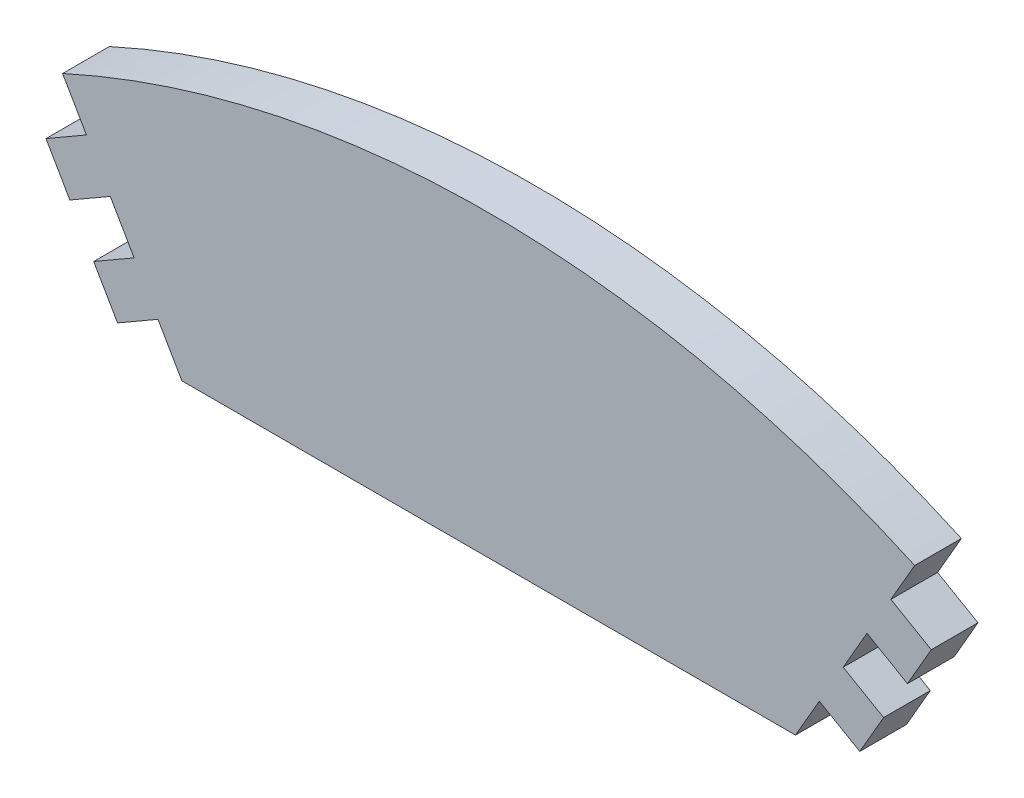
ISO-10303-21;
HEADER;
FILE_DESCRIPTION(('STEP AP214'),'2;1');
FILE_NAME('part.step','',(''),(''),'','','');
FILE_SCHEMA(('AUTOMOTIVE_DESIGN { 1 0 10303 214 1 1 1 1 }'));
ENDSEC;
DATA;
#1=APPLICATION_CONTEXT('core data for automotive mechanical design processes');
#2=APPLICATION_PROTOCOL_DEFINITION('international standard','automotive_design',2000,#1);
#3=PRODUCT_CONTEXT('',#1,'mechanical');
#4=PRODUCT('Part','Part','',(#3));
#5=PRODUCT_RELATED_PRODUCT_CATEGORY('part','',(#4));
#6=PRODUCT_DEFINITION_FORMATION('','',#4);
#7=PRODUCT_DEFINITION_CONTEXT('part definition',#1,'design');
#8=PRODUCT_DEFINITION('design','',#6,#7);
#9=PRODUCT_DEFINITION_SHAPE('','',#8);
#10=(LENGTH_UNIT() NAMED_UNIT(*) SI_UNIT(.MILLI.,.METRE.));
#11=(NAMED_UNIT(*) PLANE_ANGLE_UNIT() SI_UNIT($,.RADIAN.));
#12=(NAMED_UNIT(*) SI_UNIT($,.STERADIAN.) SOLID_ANGLE_UNIT());
#13=UNCERTAINTY_MEASURE_WITH_UNIT(LENGTH_MEASURE(1.E-05),#10,'distance_accuracy_value','');
#14=(GEOMETRIC_REPRESENTATION_CONTEXT(3) GLOBAL_UNCERTAINTY_ASSIGNED_CONTEXT((#13)) GLOBAL_UNIT_ASSIGNED_CONTEXT((#10,
#11,#12)) REPRESENTATION_CONTEXT('',''));
#15=CARTESIAN_POINT('',(0.,0.,0.));
#16=DIRECTION('',(0.,0.,1.));
#17=DIRECTION('',(1.,0.,0.));
#18=AXIS2_PLACEMENT_3D('',#15,#16,#17);
#19=CARTESIAN_POINT('',(-35.403,82.4086096476236,5.));
#20=DIRECTION('',(-0.499999999999997,0.86602540378444,0.));
#21=DIRECTION('',(-0.866025403784441,-0.499999999999997,0.));
#22=AXIS2_PLACEMENT_3D('',#19,#20,#21);
#23=PLANE('',#22);
#24=DIRECTION('',(0.86602540378444,0.499999999999997,0.));
#25=VECTOR('',#24,1.);
#26=CARTESIAN_POINT('',(-35.403,82.4086096476236,0.));
#27=LINE('',#26,#25);
#28=CARTESIAN_POINT('',(-39.733127018922,79.9086096476237,0.));
#29=VERTEX_POINT('',#28);
#30=CARTESIAN_POINT('',(-35.403,82.4086096476236,0.));
#31=VERTEX_POINT('',#30);
#32=EDGE_CURVE('E201',#29,#31,#27,.T.);
#33=ORIENTED_EDGE('',*,*,#32,.T.);
#34=DIRECTION('',(0.,0.,-1.));
#35=VECTOR('',#34,1.);
#36=CARTESIAN_POINT('',(-35.403,82.4086096476236,5.));
#37=LINE('',#36,#35);
#38=CARTESIAN_POINT('',(-35.403,82.4086096476236,5.));
#39=VERTEX_POINT('',#38);
#40=EDGE_CURVE('E11',#39,#31,#37,.T.);
#41=ORIENTED_EDGE('',*,*,#40,.F.);
#42=DIRECTION('',(0.86602540378444,0.499999999999997,0.));
#43=VECTOR('',#42,1.);
#44=CARTESIAN_POINT('',(-35.403,82.4086096476236,5.));
#45=LINE('',#44,#43);
#46=CARTESIAN_POINT('',(-39.733127018922,79.9086096476237,5.));
#47=VERTEX_POINT('',#46);
#48=EDGE_CURVE('E239',#47,#39,#45,.T.);
#49=ORIENTED_EDGE('',*,*,#48,.F.);
#50=DIRECTION('',(0.,0.,-1.));
#51=VECTOR('',#50,1.);
#52=CARTESIAN_POINT('',(-39.733127018922,79.9086096476237,5.));
#53=LINE('',#52,#51);
#54=EDGE_CURVE('E197',#47,#29,#53,.T.);
#55=ORIENTED_EDGE('',*,*,#54,.T.);
#56=EDGE_LOOP('',(#33,#41,#49,#55));
#57=FACE_BOUND('',#56,.T.);
#58=ADVANCED_FACE('F33',(#57),#23,.F.);
#59=CARTESIAN_POINT('',(-32.85,77.9866839359003,5.));
#60=DIRECTION('',(0.866025403784441,0.499999999999996,0.));
#61=DIRECTION('',(-0.499999999999996,0.866025403784441,0.));
#62=AXIS2_PLACEMENT_3D('',#59,#60,#61);
#63=PLANE('',#62);
#64=DIRECTION('',(0.499999999999996,-0.866025403784441,0.));
#65=VECTOR('',#64,1.);
#66=CARTESIAN_POINT('',(-32.85,77.9866839359003,0.));
#67=LINE('',#66,#65);
#68=CARTESIAN_POINT('',(-32.85,77.9866839359003,0.));
#69=VERTEX_POINT('',#68);
#70=EDGE_CURVE('E204',#31,#69,#67,.T.);
#71=ORIENTED_EDGE('',*,*,#70,.T.);
#72=DIRECTION('',(0.,0.,-1.));
#73=VECTOR('',#72,1.);
#74=CARTESIAN_POINT('',(-32.85,77.9866839359003,5.));
#75=LINE('',#74,#73);
#76=CARTESIAN_POINT('',(-32.85,77.9866839359003,5.));
#77=VERTEX_POINT('',#76);
#78=EDGE_CURVE('E41',#77,#69,#75,.T.);
#79=ORIENTED_EDGE('',*,*,#78,.F.);
#80=DIRECTION('',(0.499999999999996,-0.866025403784441,0.));
#81=VECTOR('',#80,1.);
#82=CARTESIAN_POINT('',(-32.85,77.9866839359003,5.));
#83=LINE('',#82,#81);
#84=EDGE_CURVE('E128',#39,#77,#83,.T.);
#85=ORIENTED_EDGE('',*,*,#84,.F.);
#86=ORIENTED_EDGE('',*,*,#40,.T.);
#87=EDGE_LOOP('',(#71,#79,#85,#86));
#88=FACE_BOUND('',#87,.T.);
#89=ADVANCED_FACE('F357',(#88),#63,.F.);
#90=CARTESIAN_POINT('',(-32.85,77.9866839359003,5.));
#91=DIRECTION('',(0.,1.,0.));
#92=DIRECTION('',(0.,0.,1.));
#93=AXIS2_PLACEMENT_3D('',#90,#91,#92);
#94=PLANE('',#93);
#95=DIRECTION('',(1.,0.,0.));
#96=VECTOR('',#95,1.);
#97=CARTESIAN_POINT('',(-32.85,77.9866839359003,0.));
#98=LINE('',#97,#96);
#99=CARTESIAN_POINT('',(32.85,77.9866839359003,0.));
#100=VERTEX_POINT('',#99);
#101=EDGE_CURVE('E206',#69,#100,#98,.T.);
#102=ORIENTED_EDGE('',*,*,#101,.T.);
#103=DIRECTION('',(0.,0.,-1.));
#104=VECTOR('',#103,1.);
#105=CARTESIAN_POINT('',(32.85,77.9866839359003,5.));
#106=LINE('',#105,#104);
#107=CARTESIAN_POINT('',(32.85,77.9866839359003,5.));
#108=VERTEX_POINT('',#107);
#109=EDGE_CURVE('E282',#108,#100,#106,.T.);
#110=ORIENTED_EDGE('',*,*,#109,.F.);
#111=DIRECTION('',(1.,0.,0.));
#112=VECTOR('',#111,1.);
#113=CARTESIAN_POINT('',(-32.85,77.9866839359003,5.));
#114=LINE('',#113,#112);
#115=EDGE_CURVE('E290',#77,#108,#114,.T.);
#116=ORIENTED_EDGE('',*,*,#115,.F.);
#117=ORIENTED_EDGE('',*,*,#78,.T.);
#118=EDGE_LOOP('',(#102,#110,#116,#117));
#119=FACE_BOUND('',#118,.T.);
#120=ADVANCED_FACE('F288',(#119),#94,.F.);
#121=CARTESIAN_POINT('',(32.85,77.9866839359003,5.));
#122=DIRECTION('',(-0.86602540378444,0.499999999999997,0.));
#123=DIRECTION('',(-0.499999999999997,-0.86602540378444,0.));
#124=AXIS2_PLACEMENT_3D('',#121,#122,#123);
#125=PLANE('',#124);
#126=DIRECTION('',(0.499999999999997,0.86602540378444,0.));
#127=VECTOR('',#126,1.);
#128=CARTESIAN_POINT('',(32.85,77.9866839359003,0.));
#129=LINE('',#128,#127);
#130=CARTESIAN_POINT('',(35.403,82.4086096476236,0.));
#131=VERTEX_POINT('',#130);
#132=EDGE_CURVE('E208',#100,#131,#129,.T.);
#133=ORIENTED_EDGE('',*,*,#132,.T.);
#134=DIRECTION('',(0.,0.,-1.));
#135=VECTOR('',#134,1.);
#136=CARTESIAN_POINT('',(35.403,82.4086096476236,5.));
#137=LINE('',#136,#135);
#138=CARTESIAN_POINT('',(35.403,82.4086096476236,5.));
#139=VERTEX_POINT('',#138);
#140=EDGE_CURVE('E279',#139,#131,#137,.T.);
#141=ORIENTED_EDGE('',*,*,#140,.F.);
#142=DIRECTION('',(0.499999999999997,0.86602540378444,0.));
#143=VECTOR('',#142,1.);
#144=CARTESIAN_POINT('',(32.85,77.9866839359003,5.));
#145=LINE('',#144,#143);
#146=EDGE_CURVE('E308',#108,#139,#145,.T.);
#147=ORIENTED_EDGE('',*,*,#146,.F.);
#148=ORIENTED_EDGE('',*,*,#109,.T.);
#149=EDGE_LOOP('',(#133,#141,#147,#148));
#150=FACE_BOUND('',#149,.T.);
#151=ADVANCED_FACE('F299',(#150),#125,.F.);
#152=CARTESIAN_POINT('',(35.403,82.4086096476236,5.));
#153=DIRECTION('',(0.499999999999997,0.86602540378444,0.));
#154=DIRECTION('',(-0.866025403784441,0.499999999999997,0.));
#155=AXIS2_PLACEMENT_3D('',#152,#153,#154);
#156=PLANE('',#155);
#157=DIRECTION('',(0.86602540378444,-0.499999999999997,0.));
#158=VECTOR('',#157,1.);
#159=CARTESIAN_POINT('',(35.403,82.4086096476236,0.));
#160=LINE('',#159,#158);
#161=CARTESIAN_POINT('',(39.733127018922,79.9086096476237,0.));
#162=VERTEX_POINT('',#161);
#163=EDGE_CURVE('E210',#131,#162,#160,.T.);
#164=ORIENTED_EDGE('',*,*,#163,.T.);
#165=DIRECTION('',(0.,0.,-1.));
#166=VECTOR('',#165,1.);
#167=CARTESIAN_POINT('',(39.733127018922,79.9086096476237,5.));
#168=LINE('',#167,#166);
#169=CARTESIAN_POINT('',(39.733127018922,79.9086096476237,5.));
#170=VERTEX_POINT('',#169);
#171=EDGE_CURVE('E276',#170,#162,#168,.T.);
#172=ORIENTED_EDGE('',*,*,#171,.F.);
#173=DIRECTION('',(0.86602540378444,-0.499999999999997,0.));
#174=VECTOR('',#173,1.);
#175=CARTESIAN_POINT('',(35.403,82.4086096476236,5.));
#176=LINE('',#175,#174);
#177=EDGE_CURVE('E305',#139,#170,#176,.T.);
#178=ORIENTED_EDGE('',*,*,#177,.F.);
#179=ORIENTED_EDGE('',*,*,#140,.T.);
#180=EDGE_LOOP('',(#164,#172,#178,#179));
#181=FACE_BOUND('',#180,.T.);
#182=ADVANCED_FACE('F303',(#181),#156,.F.);
#183=CARTESIAN_POINT('',(39.733127018922,79.9086096476237,5.));
#184=DIRECTION('',(-0.86602540378444,0.499999999999997,0.));
#185=DIRECTION('',(-0.499999999999997,-0.86602540378444,0.));
#186=AXIS2_PLACEMENT_3D('',#183,#184,#185);
#187=PLANE('',#186);
#188=DIRECTION('',(0.499999999999997,0.86602540378444,0.));
#189=VECTOR('',#188,1.);
#190=CARTESIAN_POINT('',(39.733127018922,79.9086096476237,0.));
#191=LINE('',#190,#189);
#192=CARTESIAN_POINT('',(42.286127018922,84.3305353593471,0.));
#193=VERTEX_POINT('',#192);
#194=EDGE_CURVE('E212',#162,#193,#191,.T.);
#195=ORIENTED_EDGE('',*,*,#194,.T.);
#196=DIRECTION('',(0.,0.,-1.));
#197=VECTOR('',#196,1.);
#198=CARTESIAN_POINT('',(42.286127018922,84.3305353593471,5.));
#199=LINE('',#198,#197);
#200=CARTESIAN_POINT('',(42.286127018922,84.3305353593471,5.));
#201=VERTEX_POINT('',#200);
#202=EDGE_CURVE('E273',#201,#193,#199,.T.);
#203=ORIENTED_EDGE('',*,*,#202,.F.);
#204=DIRECTION('',(0.499999999999997,0.86602540378444,0.));
#205=VECTOR('',#204,1.);
#206=CARTESIAN_POINT('',(39.733127018922,79.9086096476237,5.));
#207=LINE('',#206,#205);
#208=EDGE_CURVE('E307',#170,#201,#207,.T.);
#209=ORIENTED_EDGE('',*,*,#208,.F.);
#210=ORIENTED_EDGE('',*,*,#171,.T.);
#211=EDGE_LOOP('',(#195,#203,#209,#210));
#212=FACE_BOUND('',#211,.T.);
#213=ADVANCED_FACE('F370',(#212),#187,.F.);
#214=CARTESIAN_POINT('',(42.286127018922,84.3305353593471,5.));
#215=DIRECTION('',(-0.499999999999999,-0.866025403784439,0.));
#216=DIRECTION('',(0.866025403784439,-0.499999999999999,0.));
#217=AXIS2_PLACEMENT_3D('',#214,#215,#216);
#218=PLANE('',#217);
#219=DIRECTION('',(-0.866025403784439,0.499999999999999,0.));
#220=VECTOR('',#219,1.);
#221=CARTESIAN_POINT('',(42.286127018922,84.3305353593471,0.));
#222=LINE('',#221,#220);
#223=CARTESIAN_POINT('',(37.956,86.830535359347,0.));
#224=VERTEX_POINT('',#223);
#225=EDGE_CURVE('E214',#193,#224,#222,.T.);
#226=ORIENTED_EDGE('',*,*,#225,.T.);
#227=DIRECTION('',(0.,0.,-1.));
#228=VECTOR('',#227,1.);
#229=CARTESIAN_POINT('',(37.956,86.830535359347,5.));
#230=LINE('',#229,#228);
#231=CARTESIAN_POINT('',(37.956,86.830535359347,5.));
#232=VERTEX_POINT('',#231);
#233=EDGE_CURVE('E270',#232,#224,#230,.T.);
#234=ORIENTED_EDGE('',*,*,#233,.F.);
#235=DIRECTION('',(-0.866025403784439,0.499999999999999,0.));
#236=VECTOR('',#235,1.);
#237=CARTESIAN_POINT('',(42.286127018922,84.3305353593471,5.));
#238=LINE('',#237,#236);
#239=EDGE_CURVE('E310',#201,#232,#238,.T.);
#240=ORIENTED_EDGE('',*,*,#239,.F.);
#241=ORIENTED_EDGE('',*,*,#202,.T.);
#242=EDGE_LOOP('',(#226,#234,#240,#241));
#243=FACE_BOUND('',#242,.T.);
#244=ADVANCED_FACE('F373',(#243),#218,.F.);
#245=CARTESIAN_POINT('',(37.956,86.830535359347,5.));
#246=DIRECTION('',(-0.866025403784441,0.499999999999996,0.));
#247=DIRECTION('',(-0.499999999999996,-0.866025403784441,0.));
#248=AXIS2_PLACEMENT_3D('',#245,#246,#247);
#249=PLANE('',#248);
#250=DIRECTION('',(0.499999999999996,0.866025403784441,0.));
#251=VECTOR('',#250,1.);
#252=CARTESIAN_POINT('',(37.956,86.830535359347,0.));
#253=LINE('',#252,#251);
#254=CARTESIAN_POINT('',(40.5089999999999,91.2524610710703,0.));
#255=VERTEX_POINT('',#254);
#256=EDGE_CURVE('E216',#224,#255,#253,.T.);
#257=ORIENTED_EDGE('',*,*,#256,.T.);
#258=DIRECTION('',(0.,0.,-1.));
#259=VECTOR('',#258,1.);
#260=CARTESIAN_POINT('',(40.5089999999999,91.2524610710703,5.));
#261=LINE('',#260,#259);
#262=CARTESIAN_POINT('',(40.5089999999999,91.2524610710703,5.));
#263=VERTEX_POINT('',#262);
#264=EDGE_CURVE('E267',#263,#255,#261,.T.);
#265=ORIENTED_EDGE('',*,*,#264,.F.);
#266=DIRECTION('',(0.499999999999996,0.866025403784441,0.));
#267=VECTOR('',#266,1.);
#268=CARTESIAN_POINT('',(37.956,86.830535359347,5.));
#269=LINE('',#268,#267);
#270=EDGE_CURVE('E316',#232,#263,#269,.T.);
#271=ORIENTED_EDGE('',*,*,#270,.F.);
#272=ORIENTED_EDGE('',*,*,#233,.T.);
#273=EDGE_LOOP('',(#257,#265,#271,#272));
#274=FACE_BOUND('',#273,.T.);
#275=ADVANCED_FACE('F377',(#274),#249,.F.);
#276=CARTESIAN_POINT('',(40.5089999999999,91.2524610710703,5.));
#277=DIRECTION('',(0.499999999999997,0.86602540378444,0.));
#278=DIRECTION('',(-0.866025403784441,0.499999999999997,0.));
#279=AXIS2_PLACEMENT_3D('',#276,#277,#278);
#280=PLANE('',#279);
#281=DIRECTION('',(0.86602540378444,-0.499999999999997,0.));
#282=VECTOR('',#281,1.);
#283=CARTESIAN_POINT('',(40.5089999999999,91.2524610710703,0.));
#284=LINE('',#283,#282);
#285=CARTESIAN_POINT('',(44.839127018922,88.7524610710704,0.));
#286=VERTEX_POINT('',#285);
#287=EDGE_CURVE('E218',#255,#286,#284,.T.);
#288=ORIENTED_EDGE('',*,*,#287,.T.);
#289=DIRECTION('',(0.,0.,-1.));
#290=VECTOR('',#289,1.);
#291=CARTESIAN_POINT('',(44.839127018922,88.7524610710704,5.));
#292=LINE('',#291,#290);
#293=CARTESIAN_POINT('',(44.839127018922,88.7524610710704,5.));
#294=VERTEX_POINT('',#293);
#295=EDGE_CURVE('E264',#294,#286,#292,.T.);
#296=ORIENTED_EDGE('',*,*,#295,.F.);
#297=DIRECTION('',(0.86602540378444,-0.499999999999997,0.));
#298=VECTOR('',#297,1.);
#299=CARTESIAN_POINT('',(40.5089999999999,91.2524610710703,5.));
#300=LINE('',#299,#298);
#301=EDGE_CURVE('E318',#263,#294,#300,.T.);
#302=ORIENTED_EDGE('',*,*,#301,.F.);
#303=ORIENTED_EDGE('',*,*,#264,.T.);
#304=EDGE_LOOP('',(#288,#296,#302,#303));
#305=FACE_BOUND('',#304,.T.);
#306=ADVANCED_FACE('F381',(#305),#280,.F.);
#307=CARTESIAN_POINT('',(44.839127018922,88.7524610710704,5.));
#308=DIRECTION('',(-0.866025403784423,0.500000000000028,0.));
#309=DIRECTION('',(-0.500000000000028,-0.866025403784423,0.));
#310=AXIS2_PLACEMENT_3D('',#307,#308,#309);
#311=PLANE('',#310);
#312=DIRECTION('',(0.500000000000028,0.866025403784423,0.));
#313=VECTOR('',#312,1.);
#314=CARTESIAN_POINT('',(44.839127018922,88.7524610710704,0.));
#315=LINE('',#314,#313);
#316=CARTESIAN_POINT('',(47.3921270189221,93.1743867827937,0.));
#317=VERTEX_POINT('',#316);
#318=EDGE_CURVE('E220',#286,#317,#315,.T.);
#319=ORIENTED_EDGE('',*,*,#318,.T.);
#320=DIRECTION('',(0.,0.,-1.));
#321=VECTOR('',#320,1.);
#322=CARTESIAN_POINT('',(47.3921270189221,93.1743867827937,5.));
#323=LINE('',#322,#321);
#324=CARTESIAN_POINT('',(47.3921270189221,93.1743867827937,5.));
#325=VERTEX_POINT('',#324);
#326=EDGE_CURVE('E261',#325,#317,#323,.T.);
#327=ORIENTED_EDGE('',*,*,#326,.F.);
#328=DIRECTION('',(0.500000000000028,0.866025403784423,0.));
#329=VECTOR('',#328,1.);
#330=CARTESIAN_POINT('',(44.839127018922,88.7524610710704,5.));
#331=LINE('',#330,#329);
#332=EDGE_CURVE('E320',#294,#325,#331,.T.);
#333=ORIENTED_EDGE('',*,*,#332,.F.);
#334=ORIENTED_EDGE('',*,*,#295,.T.);
#335=EDGE_LOOP('',(#319,#327,#333,#334));
#336=FACE_BOUND('',#335,.T.);
#337=ADVANCED_FACE('F385',(#336),#311,.F.);
#338=CARTESIAN_POINT('',(47.3921270189221,93.1743867827937,5.));
#339=DIRECTION('',(-0.499999999999998,-0.86602540378444,0.));
#340=DIRECTION('',(0.86602540378444,-0.499999999999998,0.));
#341=AXIS2_PLACEMENT_3D('',#338,#339,#340);
#342=PLANE('',#341);
#343=DIRECTION('',(-0.86602540378444,0.499999999999998,0.));
#344=VECTOR('',#343,1.);
#345=CARTESIAN_POINT('',(47.3921270189221,93.1743867827937,0.));
#346=LINE('',#345,#344);
#347=CARTESIAN_POINT('',(43.0619999999999,95.6743867827937,0.));
#348=VERTEX_POINT('',#347);
#349=EDGE_CURVE('E222',#317,#348,#346,.T.);
#350=ORIENTED_EDGE('',*,*,#349,.T.);
#351=DIRECTION('',(0.,0.,-1.));
#352=VECTOR('',#351,1.);
#353=CARTESIAN_POINT('',(43.0619999999999,95.6743867827937,5.));
#354=LINE('',#353,#352);
#355=CARTESIAN_POINT('',(43.0619999999999,95.6743867827937,5.));
#356=VERTEX_POINT('',#355);
#357=EDGE_CURVE('E258',#356,#348,#354,.T.);
#358=ORIENTED_EDGE('',*,*,#357,.F.);
#359=DIRECTION('',(-0.86602540378444,0.499999999999998,0.));
#360=VECTOR('',#359,1.);
#361=CARTESIAN_POINT('',(47.3921270189221,93.1743867827937,5.));
#362=LINE('',#361,#360);
#363=EDGE_CURVE('E322',#325,#356,#362,.T.);
#364=ORIENTED_EDGE('',*,*,#363,.F.);
#365=ORIENTED_EDGE('',*,*,#326,.T.);
#366=EDGE_LOOP('',(#350,#358,#364,#365));
#367=FACE_BOUND('',#366,.T.);
#368=ADVANCED_FACE('F389',(#367),#342,.F.);
#369=CARTESIAN_POINT('',(43.0619999999999,95.6743867827937,5.));
#370=DIRECTION('',(-0.86602540378444,0.499999999999997,0.));
#371=DIRECTION('',(-0.499999999999997,-0.86602540378444,0.));
#372=AXIS2_PLACEMENT_3D('',#369,#370,#371);
#373=PLANE('',#372);
#374=DIRECTION('',(0.499999999999997,0.86602540378444,0.));
#375=VECTOR('',#374,1.);
#376=CARTESIAN_POINT('',(43.0619999999999,95.6743867827937,0.));
#377=LINE('',#376,#375);
#378=CARTESIAN_POINT('',(45.6149999999999,100.096312494517,0.));
#379=VERTEX_POINT('',#378);
#380=EDGE_CURVE('E224',#348,#379,#377,.T.);
#381=ORIENTED_EDGE('',*,*,#380,.T.);
#382=DIRECTION('',(0.,0.,-1.));
#383=VECTOR('',#382,1.);
#384=CARTESIAN_POINT('',(45.6149999999999,100.096312494517,5.));
#385=LINE('',#384,#383);
#386=CARTESIAN_POINT('',(45.6149999999999,100.096312494517,5.));
#387=VERTEX_POINT('',#386);
#388=EDGE_CURVE('E255',#387,#379,#385,.T.);
#389=ORIENTED_EDGE('',*,*,#388,.F.);
#390=DIRECTION('',(0.499999999999997,0.86602540378444,0.));
#391=VECTOR('',#390,1.);
#392=CARTESIAN_POINT('',(43.0619999999999,95.6743867827937,5.));
#393=LINE('',#392,#391);
#394=EDGE_CURVE('E324',#356,#387,#393,.T.);
#395=ORIENTED_EDGE('',*,*,#394,.F.);
#396=ORIENTED_EDGE('',*,*,#357,.T.);
#397=EDGE_LOOP('',(#381,#389,#395,#396));
#398=FACE_BOUND('',#397,.T.);
#399=ADVANCED_FACE('F393',(#398),#373,.F.);
#400=CARTESIAN_POINT('',(0.,0.,5.));
#401=DIRECTION('',(0.,0.,-1.));
#402=DIRECTION('',(-1.,0.,0.));
#403=AXIS2_PLACEMENT_3D('',#400,#401,#402);
#404=CYLINDRICAL_SURFACE('',#403,110.);
#405=CARTESIAN_POINT('',(0.,0.,0.));
#406=DIRECTION('',(0.,0.,1.));
#407=DIRECTION('',(-1.,0.,0.));
#408=AXIS2_PLACEMENT_3D('',#405,#406,#407);
#409=CIRCLE('',#408,110.);
#410=CARTESIAN_POINT('',(-45.6149999999999,100.096312494517,0.));
#411=VERTEX_POINT('',#410);
#412=EDGE_CURVE('E226',#379,#411,#409,.T.);
#413=ORIENTED_EDGE('',*,*,#412,.T.);
#414=DIRECTION('',(0.,0.,-1.));
#415=VECTOR('',#414,1.);
#416=CARTESIAN_POINT('',(-45.6149999999999,100.096312494517,5.));
#417=LINE('',#416,#415);
#418=CARTESIAN_POINT('',(-45.6149999999999,100.096312494517,5.));
#419=VERTEX_POINT('',#418);
#420=EDGE_CURVE('E252',#419,#411,#417,.T.);
#421=ORIENTED_EDGE('',*,*,#420,.F.);
#422=CARTESIAN_POINT('',(0.,0.,5.));
#423=DIRECTION('',(0.,0.,1.));
#424=DIRECTION('',(-1.,0.,0.));
#425=AXIS2_PLACEMENT_3D('',#422,#423,#424);
#426=CIRCLE('',#425,110.);
#427=EDGE_CURVE('E326',#387,#419,#426,.T.);
#428=ORIENTED_EDGE('',*,*,#427,.F.);
#429=ORIENTED_EDGE('',*,*,#388,.T.);
#430=EDGE_LOOP('',(#413,#421,#428,#429));
#431=FACE_BOUND('',#430,.T.);
#432=ADVANCED_FACE('F397',(#431),#404,.T.);
#433=CARTESIAN_POINT('',(-43.0619999999999,95.6743867827937,5.));
#434=DIRECTION('',(0.86602540378444,0.499999999999997,0.));
#435=DIRECTION('',(-0.499999999999997,0.86602540378444,0.));
#436=AXIS2_PLACEMENT_3D('',#433,#434,#435);
#437=PLANE('',#436);
#438=DIRECTION('',(0.499999999999997,-0.86602540378444,0.));
#439=VECTOR('',#438,1.);
#440=CARTESIAN_POINT('',(-43.0619999999999,95.6743867827937,0.));
#441=LINE('',#440,#439);
#442=CARTESIAN_POINT('',(-43.0619999999999,95.6743867827937,0.));
#443=VERTEX_POINT('',#442);
#444=EDGE_CURVE('E228',#411,#443,#441,.T.);
#445=ORIENTED_EDGE('',*,*,#444,.T.);
#446=DIRECTION('',(0.,0.,-1.));
#447=VECTOR('',#446,1.);
#448=CARTESIAN_POINT('',(-43.0619999999999,95.6743867827937,5.));
#449=LINE('',#448,#447);
#450=CARTESIAN_POINT('',(-43.0619999999999,95.6743867827937,5.));
#451=VERTEX_POINT('',#450);
#452=EDGE_CURVE('E249',#451,#443,#449,.T.);
#453=ORIENTED_EDGE('',*,*,#452,.F.);
#454=DIRECTION('',(0.499999999999997,-0.86602540378444,0.));
#455=VECTOR('',#454,1.);
#456=CARTESIAN_POINT('',(-43.0619999999999,95.6743867827937,5.));
#457=LINE('',#456,#455);
#458=EDGE_CURVE('E328',#419,#451,#457,.T.);
#459=ORIENTED_EDGE('',*,*,#458,.F.);
#460=ORIENTED_EDGE('',*,*,#420,.T.);
#461=EDGE_LOOP('',(#445,#453,#459,#460));
#462=FACE_BOUND('',#461,.T.);
#463=ADVANCED_FACE('F401',(#462),#437,.F.);
#464=CARTESIAN_POINT('',(-47.3921270189221,93.1743867827937,5.));
#465=DIRECTION('',(0.499999999999998,-0.86602540378444,0.));
#466=DIRECTION('',(0.86602540378444,0.499999999999998,0.));
#467=AXIS2_PLACEMENT_3D('',#464,#465,#466);
#468=PLANE('',#467);
#469=DIRECTION('',(-0.86602540378444,-0.499999999999998,0.));
#470=VECTOR('',#469,1.);
#471=CARTESIAN_POINT('',(-47.3921270189221,93.1743867827937,0.));
#472=LINE('',#471,#470);
#473=CARTESIAN_POINT('',(-47.3921270189221,93.1743867827937,0.));
#474=VERTEX_POINT('',#473);
#475=EDGE_CURVE('E230',#443,#474,#472,.T.);
#476=ORIENTED_EDGE('',*,*,#475,.T.);
#477=DIRECTION('',(0.,0.,-1.));
#478=VECTOR('',#477,1.);
#479=CARTESIAN_POINT('',(-47.3921270189221,93.1743867827937,5.));
#480=LINE('',#479,#478);
#481=CARTESIAN_POINT('',(-47.3921270189221,93.1743867827937,5.));
#482=VERTEX_POINT('',#481);
#483=EDGE_CURVE('E246',#482,#474,#480,.T.);
#484=ORIENTED_EDGE('',*,*,#483,.F.);
#485=DIRECTION('',(-0.86602540378444,-0.499999999999998,0.));
#486=VECTOR('',#485,1.);
#487=CARTESIAN_POINT('',(-47.3921270189221,93.1743867827937,5.));
#488=LINE('',#487,#486);
#489=EDGE_CURVE('E330',#451,#482,#488,.T.);
#490=ORIENTED_EDGE('',*,*,#489,.F.);
#491=ORIENTED_EDGE('',*,*,#452,.T.);
#492=EDGE_LOOP('',(#476,#484,#490,#491));
#493=FACE_BOUND('',#492,.T.);
#494=ADVANCED_FACE('F405',(#493),#468,.F.);
#495=CARTESIAN_POINT('',(-44.839127018922,88.7524610710704,5.));
#496=DIRECTION('',(0.866025403784423,0.500000000000028,0.));
#497=DIRECTION('',(-0.500000000000028,0.866025403784423,0.));
#498=AXIS2_PLACEMENT_3D('',#495,#496,#497);
#499=PLANE('',#498);
#500=DIRECTION('',(0.500000000000028,-0.866025403784423,0.));
#501=VECTOR('',#500,1.);
#502=CARTESIAN_POINT('',(-44.839127018922,88.7524610710704,0.));
#503=LINE('',#502,#501);
#504=CARTESIAN_POINT('',(-44.839127018922,88.7524610710704,0.));
#505=VERTEX_POINT('',#504);
#506=EDGE_CURVE('E232',#474,#505,#503,.T.);
#507=ORIENTED_EDGE('',*,*,#506,.T.);
#508=DIRECTION('',(0.,0.,-1.));
#509=VECTOR('',#508,1.);
#510=CARTESIAN_POINT('',(-44.839127018922,88.7524610710704,5.));
#511=LINE('',#510,#509);
#512=CARTESIAN_POINT('',(-44.839127018922,88.7524610710704,5.));
#513=VERTEX_POINT('',#512);
#514=EDGE_CURVE('E243',#513,#505,#511,.T.);
#515=ORIENTED_EDGE('',*,*,#514,.F.);
#516=DIRECTION('',(0.500000000000028,-0.866025403784423,0.));
#517=VECTOR('',#516,1.);
#518=CARTESIAN_POINT('',(-44.839127018922,88.7524610710704,5.));
#519=LINE('',#518,#517);
#520=EDGE_CURVE('E332',#482,#513,#519,.T.);
#521=ORIENTED_EDGE('',*,*,#520,.F.);
#522=ORIENTED_EDGE('',*,*,#483,.T.);
#523=EDGE_LOOP('',(#507,#515,#521,#522));
#524=FACE_BOUND('',#523,.T.);
#525=ADVANCED_FACE('F338',(#524),#499,.F.);
#526=CARTESIAN_POINT('',(-40.5089999999999,91.2524610710703,5.));
#527=DIRECTION('',(-0.499999999999997,0.86602540378444,0.));
#528=DIRECTION('',(-0.866025403784441,-0.499999999999997,0.));
#529=AXIS2_PLACEMENT_3D('',#526,#527,#528);
#530=PLANE('',#529);
#531=DIRECTION('',(0.86602540378444,0.499999999999997,0.));
#532=VECTOR('',#531,1.);
#533=CARTESIAN_POINT('',(-40.5089999999999,91.2524610710703,0.));
#534=LINE('',#533,#532);
#535=CARTESIAN_POINT('',(-40.5089999999999,91.2524610710703,0.));
#536=VERTEX_POINT('',#535);
#537=EDGE_CURVE('E234',#505,#536,#534,.T.);
#538=ORIENTED_EDGE('',*,*,#537,.T.);
#539=DIRECTION('',(0.,0.,-1.));
#540=VECTOR('',#539,1.);
#541=CARTESIAN_POINT('',(-40.5089999999999,91.2524610710703,5.));
#542=LINE('',#541,#540);
#543=CARTESIAN_POINT('',(-40.5089999999999,91.2524610710703,5.));
#544=VERTEX_POINT('',#543);
#545=EDGE_CURVE('E192',#544,#536,#542,.T.);
#546=ORIENTED_EDGE('',*,*,#545,.F.);
#547=DIRECTION('',(0.86602540378444,0.499999999999997,0.));
#548=VECTOR('',#547,1.);
#549=CARTESIAN_POINT('',(-40.5089999999999,91.2524610710703,5.));
#550=LINE('',#549,#548);
#551=EDGE_CURVE('E183',#513,#544,#550,.T.);
#552=ORIENTED_EDGE('',*,*,#551,.F.);
#553=ORIENTED_EDGE('',*,*,#514,.T.);
#554=EDGE_LOOP('',(#538,#546,#552,#553));
#555=FACE_BOUND('',#554,.T.);
#556=ADVANCED_FACE('F342',(#555),#530,.F.);
#557=CARTESIAN_POINT('',(-37.956,86.830535359347,5.));
#558=DIRECTION('',(0.866025403784441,0.499999999999996,0.));
#559=DIRECTION('',(-0.499999999999996,0.866025403784441,0.));
#560=AXIS2_PLACEMENT_3D('',#557,#558,#559);
#561=PLANE('',#560);
#562=DIRECTION('',(0.499999999999996,-0.866025403784441,0.));
#563=VECTOR('',#562,1.);
#564=CARTESIAN_POINT('',(-37.956,86.830535359347,0.));
#565=LINE('',#564,#563);
#566=CARTESIAN_POINT('',(-37.956,86.830535359347,0.));
#567=VERTEX_POINT('',#566);
#568=EDGE_CURVE('E191',#536,#567,#565,.T.);
#569=ORIENTED_EDGE('',*,*,#568,.T.);
#570=DIRECTION('',(0.,0.,-1.));
#571=VECTOR('',#570,1.);
#572=CARTESIAN_POINT('',(-37.956,86.830535359347,5.));
#573=LINE('',#572,#571);
#574=CARTESIAN_POINT('',(-37.956,86.830535359347,5.));
#575=VERTEX_POINT('',#574);
#576=EDGE_CURVE('E188',#575,#567,#573,.T.);
#577=ORIENTED_EDGE('',*,*,#576,.F.);
#578=DIRECTION('',(0.499999999999996,-0.866025403784441,0.));
#579=VECTOR('',#578,1.);
#580=CARTESIAN_POINT('',(-37.956,86.830535359347,5.));
#581=LINE('',#580,#579);
#582=EDGE_CURVE('E177',#544,#575,#581,.T.);
#583=ORIENTED_EDGE('',*,*,#582,.F.);
#584=ORIENTED_EDGE('',*,*,#545,.T.);
#585=EDGE_LOOP('',(#569,#577,#583,#584));
#586=FACE_BOUND('',#585,.T.);
#587=ADVANCED_FACE('F189',(#586),#561,.F.);
#588=CARTESIAN_POINT('',(-42.286127018922,84.3305353593471,5.));
#589=DIRECTION('',(0.499999999999999,-0.866025403784439,0.));
#590=DIRECTION('',(0.866025403784439,0.499999999999999,0.));
#591=AXIS2_PLACEMENT_3D('',#588,#589,#590);
#592=PLANE('',#591);
#593=DIRECTION('',(-0.866025403784439,-0.499999999999999,0.));
#594=VECTOR('',#593,1.);
#595=CARTESIAN_POINT('',(-42.286127018922,84.3305353593471,0.));
#596=LINE('',#595,#594);
#597=CARTESIAN_POINT('',(-42.286127018922,84.3305353593471,0.));
#598=VERTEX_POINT('',#597);
#599=EDGE_CURVE('E114',#567,#598,#596,.T.);
#600=ORIENTED_EDGE('',*,*,#599,.T.);
#601=DIRECTION('',(0.,0.,-1.));
#602=VECTOR('',#601,1.);
#603=CARTESIAN_POINT('',(-42.286127018922,84.3305353593471,5.));
#604=LINE('',#603,#602);
#605=CARTESIAN_POINT('',(-42.286127018922,84.3305353593471,5.));
#606=VERTEX_POINT('',#605);
#607=EDGE_CURVE('E193',#606,#598,#604,.T.);
#608=ORIENTED_EDGE('',*,*,#607,.F.);
#609=DIRECTION('',(-0.866025403784439,-0.499999999999999,0.));
#610=VECTOR('',#609,1.);
#611=CARTESIAN_POINT('',(-42.286127018922,84.3305353593471,5.));
#612=LINE('',#611,#610);
#613=EDGE_CURVE('E181',#575,#606,#612,.T.);
#614=ORIENTED_EDGE('',*,*,#613,.F.);
#615=ORIENTED_EDGE('',*,*,#576,.T.);
#616=EDGE_LOOP('',(#600,#608,#614,#615));
#617=FACE_BOUND('',#616,.T.);
#618=ADVANCED_FACE('F195',(#617),#592,.F.);
#619=CARTESIAN_POINT('',(-39.733127018922,79.9086096476237,5.));
#620=DIRECTION('',(0.86602540378444,0.499999999999997,0.));
#621=DIRECTION('',(-0.499999999999997,0.86602540378444,0.));
#622=AXIS2_PLACEMENT_3D('',#619,#620,#621);
#623=PLANE('',#622);
#624=DIRECTION('',(0.499999999999997,-0.86602540378444,0.));
#625=VECTOR('',#624,1.);
#626=CARTESIAN_POINT('',(-39.733127018922,79.9086096476237,0.));
#627=LINE('',#626,#625);
#628=EDGE_CURVE('E120',#598,#29,#627,.T.);
#629=ORIENTED_EDGE('',*,*,#628,.T.);
#630=ORIENTED_EDGE('',*,*,#54,.F.);
#631=DIRECTION('',(0.499999999999997,-0.86602540378444,0.));
#632=VECTOR('',#631,1.);
#633=CARTESIAN_POINT('',(-39.733127018922,79.9086096476237,5.));
#634=LINE('',#633,#632);
#635=EDGE_CURVE('E49',#606,#47,#634,.T.);
#636=ORIENTED_EDGE('',*,*,#635,.F.);
#637=ORIENTED_EDGE('',*,*,#607,.T.);
#638=EDGE_LOOP('',(#629,#630,#636,#637));
#639=FACE_BOUND('',#638,.T.);
#640=ADVANCED_FACE('F346',(#639),#623,.F.);
#641=CARTESIAN_POINT('',(0.,0.,5.));
#642=DIRECTION('',(0.,0.,-1.));
#643=DIRECTION('',(-1.,0.,0.));
#644=AXIS2_PLACEMENT_3D('',#641,#642,#643);
#645=PLANE('',#644);
#646=ORIENTED_EDGE('',*,*,#48,.T.);
#647=ORIENTED_EDGE('',*,*,#84,.T.);
#648=ORIENTED_EDGE('',*,*,#115,.T.);
#649=ORIENTED_EDGE('',*,*,#146,.T.);
#650=ORIENTED_EDGE('',*,*,#177,.T.);
#651=ORIENTED_EDGE('',*,*,#208,.T.);
#652=ORIENTED_EDGE('',*,*,#239,.T.);
#653=ORIENTED_EDGE('',*,*,#270,.T.);
#654=ORIENTED_EDGE('',*,*,#301,.T.);
#655=ORIENTED_EDGE('',*,*,#332,.T.);
#656=ORIENTED_EDGE('',*,*,#363,.T.);
#657=ORIENTED_EDGE('',*,*,#394,.T.);
#658=ORIENTED_EDGE('',*,*,#427,.T.);
#659=ORIENTED_EDGE('',*,*,#458,.T.);
#660=ORIENTED_EDGE('',*,*,#489,.T.);
#661=ORIENTED_EDGE('',*,*,#520,.T.);
#662=ORIENTED_EDGE('',*,*,#551,.T.);
#663=ORIENTED_EDGE('',*,*,#582,.T.);
#664=ORIENTED_EDGE('',*,*,#613,.T.);
#665=ORIENTED_EDGE('',*,*,#635,.T.);
#666=EDGE_LOOP('',(#646,#647,#648,#649,#650,#651,#652,#653,#654,#655,#656,#657,#658,#659,#660,
#661,#662,#663,#664,#665));
#667=FACE_BOUND('',#666,.T.);
#668=ADVANCED_FACE('F179',(#667),#645,.F.);
#669=CARTESIAN_POINT('',(0.,0.,0.));
#670=DIRECTION('',(0.,0.,-1.));
#671=DIRECTION('',(-1.,0.,0.));
#672=AXIS2_PLACEMENT_3D('',#669,#670,#671);
#673=PLANE('',#672);
#674=ORIENTED_EDGE('',*,*,#32,.F.);
#675=ORIENTED_EDGE('',*,*,#628,.F.);
#676=ORIENTED_EDGE('',*,*,#599,.F.);
#677=ORIENTED_EDGE('',*,*,#568,.F.);
#678=ORIENTED_EDGE('',*,*,#537,.F.);
#679=ORIENTED_EDGE('',*,*,#506,.F.);
#680=ORIENTED_EDGE('',*,*,#475,.F.);
#681=ORIENTED_EDGE('',*,*,#444,.F.);
#682=ORIENTED_EDGE('',*,*,#412,.F.);
#683=ORIENTED_EDGE('',*,*,#380,.F.);
#684=ORIENTED_EDGE('',*,*,#349,.F.);
#685=ORIENTED_EDGE('',*,*,#318,.F.);
#686=ORIENTED_EDGE('',*,*,#287,.F.);
#687=ORIENTED_EDGE('',*,*,#256,.F.);
#688=ORIENTED_EDGE('',*,*,#225,.F.);
#689=ORIENTED_EDGE('',*,*,#194,.F.);
#690=ORIENTED_EDGE('',*,*,#163,.F.);
#691=ORIENTED_EDGE('',*,*,#132,.F.);
#692=ORIENTED_EDGE('',*,*,#101,.F.);
#693=ORIENTED_EDGE('',*,*,#70,.F.);
#694=EDGE_LOOP('',(#674,#675,#676,#677,#678,#679,#680,#681,#682,#683,#684,#685,#686,#687,#688,
#689,#690,#691,#692,#693));
#695=FACE_BOUND('',#694,.T.);
#696=ADVANCED_FACE('F294',(#695),#673,.T.);
#697=CLOSED_SHELL('',(#58,#89,#120,#151,#182,#213,#244,#275,#306,#337,#368,#399,#432,#463,#494,
#525,#556,#587,#618,#640,#668,#696));
#698=MANIFOLD_SOLID_BREP('B2',#697);
#699=ADVANCED_BREP_SHAPE_REPRESENTATION('',(#18,#698),#14);
#700=SHAPE_DEFINITION_REPRESENTATION(#9,#699);
ENDSEC;
END-ISO-10303-21;
